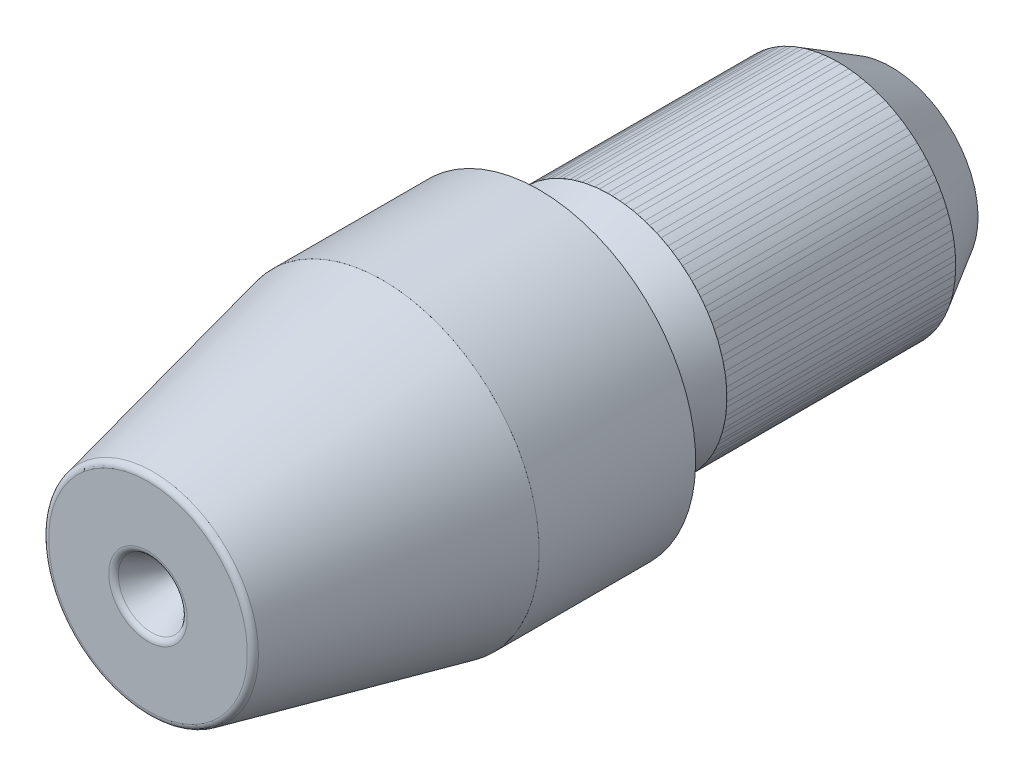
ISO-10303-21;
HEADER;
FILE_DESCRIPTION(('STEP AP214'),'2;1');
FILE_NAME('part.step','',(''),(''),'','','');
FILE_SCHEMA(('AUTOMOTIVE_DESIGN { 1 0 10303 214 1 1 1 1 }'));
ENDSEC;
DATA;
#1=APPLICATION_CONTEXT('core data for automotive mechanical design processes');
#2=APPLICATION_PROTOCOL_DEFINITION('international standard','automotive_design',2000,#1);
#3=PRODUCT_CONTEXT('',#1,'mechanical');
#4=PRODUCT('Part','Part','',(#3));
#5=PRODUCT_RELATED_PRODUCT_CATEGORY('part','',(#4));
#6=PRODUCT_DEFINITION_FORMATION('','',#4);
#7=PRODUCT_DEFINITION_CONTEXT('part definition',#1,'design');
#8=PRODUCT_DEFINITION('design','',#6,#7);
#9=PRODUCT_DEFINITION_SHAPE('','',#8);
#10=(LENGTH_UNIT() NAMED_UNIT(*) SI_UNIT(.MILLI.,.METRE.));
#11=(NAMED_UNIT(*) PLANE_ANGLE_UNIT() SI_UNIT($,.RADIAN.));
#12=(NAMED_UNIT(*) SI_UNIT($,.STERADIAN.) SOLID_ANGLE_UNIT());
#13=UNCERTAINTY_MEASURE_WITH_UNIT(LENGTH_MEASURE(1.E-05),#10,'distance_accuracy_value','');
#14=(GEOMETRIC_REPRESENTATION_CONTEXT(3) GLOBAL_UNCERTAINTY_ASSIGNED_CONTEXT((#13)) GLOBAL_UNIT_ASSIGNED_CONTEXT((#10,
#11,#12)) REPRESENTATION_CONTEXT('',''));
#15=CARTESIAN_POINT('',(0.,0.,0.));
#16=DIRECTION('',(0.,0.,1.));
#17=DIRECTION('',(1.,0.,0.));
#18=AXIS2_PLACEMENT_3D('',#15,#16,#17);
#19=CARTESIAN_POINT('',(0.,0.,-2.3));
#20=DIRECTION('',(0.,0.,-1.));
#21=DIRECTION('',(-1.,0.,0.));
#22=AXIS2_PLACEMENT_3D('',#19,#20,#21);
#23=CYLINDRICAL_SURFACE('',#22,3.001);
#24=CARTESIAN_POINT('',(0.,0.,-2.3));
#25=DIRECTION('',(0.,0.,-1.));
#26=DIRECTION('',(-1.,0.,0.));
#27=AXIS2_PLACEMENT_3D('',#24,#25,#26);
#28=CIRCLE('',#27,3.001);
#29=CARTESIAN_POINT('',(-3.001,0.,-2.3));
#30=VERTEX_POINT('',#29);
#31=EDGE_CURVE('E11',#30,#30,#28,.T.);
#32=ORIENTED_EDGE('',*,*,#31,.T.);
#33=EDGE_LOOP('',(#32));
#34=FACE_BOUND('',#33,.T.);
#35=CARTESIAN_POINT('',(0.,0.,-8.15));
#36=DIRECTION('',(0.,0.,-1.));
#37=DIRECTION('',(-1.,0.,0.));
#38=AXIS2_PLACEMENT_3D('',#35,#36,#37);
#39=CIRCLE('',#38,3.001);
#40=CARTESIAN_POINT('',(-3.001,0.,-8.15));
#41=VERTEX_POINT('',#40);
#42=EDGE_CURVE('E44',#41,#41,#39,.T.);
#43=ORIENTED_EDGE('',*,*,#42,.F.);
#44=EDGE_LOOP('',(#43));
#45=FACE_BOUND('',#44,.T.);
#46=ADVANCED_FACE('F41',(#34,#45),#23,.T.);
#47=CARTESIAN_POINT('',(0.,0.,-2.3));
#48=DIRECTION('',(0.,0.,-1.));
#49=DIRECTION('',(-1.,0.,0.));
#50=AXIS2_PLACEMENT_3D('',#47,#48,#49);
#51=PLANE('',#50);
#52=CARTESIAN_POINT('',(0.,0.,-2.3));
#53=DIRECTION('',(0.,0.,-1.));
#54=DIRECTION('',(-1.,0.,0.));
#55=AXIS2_PLACEMENT_3D('',#52,#53,#54);
#56=CIRCLE('',#55,3.);
#57=CARTESIAN_POINT('',(-3.,0.,-2.3));
#58=VERTEX_POINT('',#57);
#59=EDGE_CURVE('E51',#58,#58,#56,.T.);
#60=ORIENTED_EDGE('',*,*,#59,.T.);
#61=EDGE_LOOP('',(#60));
#62=FACE_BOUND('',#61,.T.);
#63=ORIENTED_EDGE('',*,*,#31,.F.);
#64=EDGE_LOOP('',(#63));
#65=FACE_BOUND('',#64,.T.);
#66=ADVANCED_FACE('F59',(#62,#65),#51,.F.);
#67=CARTESIAN_POINT('',(0.,0.,-8.15));
#68=DIRECTION('',(0.,0.,-1.));
#69=DIRECTION('',(-1.,0.,0.));
#70=AXIS2_PLACEMENT_3D('',#67,#68,#69);
#71=PLANE('',#70);
#72=CARTESIAN_POINT('',(0.,0.,-8.15));
#73=DIRECTION('',(0.,0.,-1.));
#74=DIRECTION('',(-1.,0.,0.));
#75=AXIS2_PLACEMENT_3D('',#72,#73,#74);
#76=CIRCLE('',#75,3.);
#77=CARTESIAN_POINT('',(-3.,0.,-8.15));
#78=VERTEX_POINT('',#77);
#79=EDGE_CURVE('E53',#78,#78,#76,.T.);
#80=ORIENTED_EDGE('',*,*,#79,.F.);
#81=EDGE_LOOP('',(#80));
#82=FACE_BOUND('',#81,.T.);
#83=ORIENTED_EDGE('',*,*,#42,.T.);
#84=EDGE_LOOP('',(#83));
#85=FACE_BOUND('',#84,.T.);
#86=ADVANCED_FACE('F65',(#82,#85),#71,.T.);
#87=CARTESIAN_POINT('',(0.,0.,-2.3));
#88=DIRECTION('',(0.,0.,-1.));
#89=DIRECTION('',(-1.,0.,0.));
#90=AXIS2_PLACEMENT_3D('',#87,#88,#89);
#91=CYLINDRICAL_SURFACE('',#90,3.);
#92=ORIENTED_EDGE('',*,*,#59,.F.);
#93=EDGE_LOOP('',(#92));
#94=FACE_BOUND('',#93,.T.);
#95=ORIENTED_EDGE('',*,*,#79,.T.);
#96=EDGE_LOOP('',(#95));
#97=FACE_BOUND('',#96,.T.);
#98=ADVANCED_FACE('F62',(#94,#97),#91,.F.);
#99=CLOSED_SHELL('',(#46,#66,#86,#98));
#100=MANIFOLD_SOLID_BREP('B2',#99);
#101=CARTESIAN_POINT('',(0.,0.,3.5));
#102=DIRECTION('',(0.,0.,-1.));
#103=DIRECTION('',(0.,1.,0.));
#104=AXIS2_PLACEMENT_3D('',#101,#102,#103);
#105=CYLINDRICAL_SURFACE('',#104,4.001);
#106=CARTESIAN_POINT('',(0.,0.,3.5));
#107=DIRECTION('',(0.,0.,-1.));
#108=DIRECTION('',(0.,1.,0.));
#109=AXIS2_PLACEMENT_3D('',#106,#107,#108);
#110=CIRCLE('',#109,4.001);
#111=CARTESIAN_POINT('',(0.,4.001,3.5));
#112=VERTEX_POINT('',#111);
#113=EDGE_CURVE('E40',#112,#112,#110,.T.);
#114=ORIENTED_EDGE('',*,*,#113,.T.);
#115=EDGE_LOOP('',(#114));
#116=FACE_BOUND('',#115,.T.);
#117=CARTESIAN_POINT('',(0.,0.,-0.500000000000001));
#118=DIRECTION('',(0.,0.,-1.));
#119=DIRECTION('',(0.,1.,0.));
#120=AXIS2_PLACEMENT_3D('',#117,#118,#119);
#121=CIRCLE('',#120,4.001);
#122=CARTESIAN_POINT('',(0.,4.001,-0.5));
#123=VERTEX_POINT('',#122);
#124=EDGE_CURVE('E112',#123,#123,#121,.T.);
#125=ORIENTED_EDGE('',*,*,#124,.F.);
#126=EDGE_LOOP('',(#125));
#127=FACE_BOUND('',#126,.T.);
#128=ADVANCED_FACE('F109',(#116,#127),#105,.T.);
#129=CARTESIAN_POINT('',(0.,0.,3.5));
#130=DIRECTION('',(0.,0.,-1.));
#131=DIRECTION('',(0.,1.,0.));
#132=AXIS2_PLACEMENT_3D('',#129,#130,#131);
#133=PLANE('',#132);
#134=CARTESIAN_POINT('',(0.,0.,3.5));
#135=DIRECTION('',(0.,0.,-1.));
#136=DIRECTION('',(0.,1.,0.));
#137=AXIS2_PLACEMENT_3D('',#134,#135,#136);
#138=CIRCLE('',#137,4.);
#139=CARTESIAN_POINT('',(0.,4.,3.5));
#140=VERTEX_POINT('',#139);
#141=EDGE_CURVE('E119',#140,#140,#138,.T.);
#142=ORIENTED_EDGE('',*,*,#141,.T.);
#143=EDGE_LOOP('',(#142));
#144=FACE_BOUND('',#143,.T.);
#145=ORIENTED_EDGE('',*,*,#113,.F.);
#146=EDGE_LOOP('',(#145));
#147=FACE_BOUND('',#146,.T.);
#148=ADVANCED_FACE('F127',(#144,#147),#133,.F.);
#149=CARTESIAN_POINT('',(0.,0.,-0.500000000000001));
#150=DIRECTION('',(0.,0.,-1.));
#151=DIRECTION('',(0.,1.,0.));
#152=AXIS2_PLACEMENT_3D('',#149,#150,#151);
#153=PLANE('',#152);
#154=CARTESIAN_POINT('',(0.,0.,-0.500000000000001));
#155=DIRECTION('',(0.,0.,-1.));
#156=DIRECTION('',(0.,1.,0.));
#157=AXIS2_PLACEMENT_3D('',#154,#155,#156);
#158=CIRCLE('',#157,4.);
#159=CARTESIAN_POINT('',(0.,4.,-0.5));
#160=VERTEX_POINT('',#159);
#161=EDGE_CURVE('E121',#160,#160,#158,.T.);
#162=ORIENTED_EDGE('',*,*,#161,.F.);
#163=EDGE_LOOP('',(#162));
#164=FACE_BOUND('',#163,.T.);
#165=ORIENTED_EDGE('',*,*,#124,.T.);
#166=EDGE_LOOP('',(#165));
#167=FACE_BOUND('',#166,.T.);
#168=ADVANCED_FACE('F133',(#164,#167),#153,.T.);
#169=CARTESIAN_POINT('',(0.,0.,3.5));
#170=DIRECTION('',(0.,0.,-1.));
#171=DIRECTION('',(0.,1.,0.));
#172=AXIS2_PLACEMENT_3D('',#169,#170,#171);
#173=CYLINDRICAL_SURFACE('',#172,4.);
#174=ORIENTED_EDGE('',*,*,#141,.F.);
#175=EDGE_LOOP('',(#174));
#176=FACE_BOUND('',#175,.T.);
#177=ORIENTED_EDGE('',*,*,#161,.T.);
#178=EDGE_LOOP('',(#177));
#179=FACE_BOUND('',#178,.T.);
#180=ADVANCED_FACE('F130',(#176,#179),#173,.F.);
#181=CLOSED_SHELL('',(#128,#148,#168,#180));
#182=MANIFOLD_SOLID_BREP('B6',#181);
#183=CARTESIAN_POINT('',(0.,0.,9.5));
#184=DIRECTION('',(0.,0.,1.));
#185=DIRECTION('',(0.,-1.,0.));
#186=AXIS2_PLACEMENT_3D('',#183,#184,#185);
#187=PLANE('',#186);
#188=CARTESIAN_POINT('',(0.,0.,9.5));
#189=DIRECTION('',(0.,0.,1.));
#190=DIRECTION('',(0.,-1.,0.));
#191=AXIS2_PLACEMENT_3D('',#188,#189,#190);
#192=CIRCLE('',#191,1.00392304845413);
#193=CARTESIAN_POINT('',(0.,-1.00392304845413,9.5));
#194=VERTEX_POINT('',#193);
#195=EDGE_CURVE('E108',#194,#194,#192,.F.);
#196=ORIENTED_EDGE('',*,*,#195,.T.);
#197=EDGE_LOOP('',(#196));
#198=FACE_BOUND('',#197,.T.);
#199=CARTESIAN_POINT('',(0.,0.,9.5));
#200=DIRECTION('',(0.,0.,1.));
#201=DIRECTION('',(0.,-1.,0.));
#202=AXIS2_PLACEMENT_3D('',#199,#200,#201);
#203=CIRCLE('',#202,2.54141844787495);
#204=CARTESIAN_POINT('',(0.,-2.54141844787495,9.5));
#205=VERTEX_POINT('',#204);
#206=EDGE_CURVE('E190',#205,#205,#203,.T.);
#207=ORIENTED_EDGE('',*,*,#206,.T.);
#208=EDGE_LOOP('',(#207));
#209=FACE_BOUND('',#208,.T.);
#210=ADVANCED_FACE('F170',(#198,#209),#187,.T.);
#211=CARTESIAN_POINT('',(0.,0.,3.5));
#212=DIRECTION('',(0.,0.,-1.));
#213=DIRECTION('',(0.,1.,0.));
#214=AXIS2_PLACEMENT_3D('',#211,#212,#213);
#215=CONICAL_SURFACE('',#214,4.,0.218166156499285);
#216=CARTESIAN_POINT('',(0.,0.,9.37463033823009));
#217=DIRECTION('',(0.,0.,1.));
#218=DIRECTION('',(0.,-1.,0.));
#219=AXIS2_PLACEMENT_3D('',#216,#217,#218);
#220=CIRCLE('',#219,2.69762580901414);
#221=CARTESIAN_POINT('',(0.,-2.69762580901414,9.37463033823009));
#222=VERTEX_POINT('',#221);
#223=EDGE_CURVE('E193',#222,#222,#220,.F.);
#224=ORIENTED_EDGE('',*,*,#223,.T.);
#225=EDGE_LOOP('',(#224));
#226=FACE_BOUND('',#225,.T.);
#227=CARTESIAN_POINT('',(0.,0.,3.5));
#228=DIRECTION('',(0.,0.,-1.));
#229=DIRECTION('',(0.,1.,0.));
#230=AXIS2_PLACEMENT_3D('',#227,#228,#229);
#231=CIRCLE('',#230,4.);
#232=CARTESIAN_POINT('',(0.,4.,3.5));
#233=VERTEX_POINT('',#232);
#234=EDGE_CURVE('E196',#233,#233,#231,.T.);
#235=ORIENTED_EDGE('',*,*,#234,.F.);
#236=EDGE_LOOP('',(#235));
#237=FACE_BOUND('',#236,.T.);
#238=ADVANCED_FACE('F250',(#226,#237),#215,.T.);
#239=CARTESIAN_POINT('',(0.,0.,-9.5));
#240=DIRECTION('',(0.,0.,-1.));
#241=DIRECTION('',(0.,1.,0.));
#242=AXIS2_PLACEMENT_3D('',#239,#240,#241);
#243=CYLINDRICAL_SURFACE('',#242,4.);
#244=ORIENTED_EDGE('',*,*,#234,.T.);
#245=EDGE_LOOP('',(#244));
#246=FACE_BOUND('',#245,.T.);
#247=CARTESIAN_POINT('',(0.,0.,-0.5));
#248=DIRECTION('',(0.,0.,-1.));
#249=DIRECTION('',(0.,1.,0.));
#250=AXIS2_PLACEMENT_3D('',#247,#248,#249);
#251=CIRCLE('',#250,4.);
#252=CARTESIAN_POINT('',(0.,4.,-0.5));
#253=VERTEX_POINT('',#252);
#254=EDGE_CURVE('E199',#253,#253,#251,.T.);
#255=ORIENTED_EDGE('',*,*,#254,.F.);
#256=EDGE_LOOP('',(#255));
#257=FACE_BOUND('',#256,.T.);
#258=ADVANCED_FACE('F255',(#246,#257),#243,.T.);
#259=CARTESIAN_POINT('',(0.,4.,-0.5));
#260=DIRECTION('',(0.,0.,-1.));
#261=DIRECTION('',(0.,1.,0.));
#262=AXIS2_PLACEMENT_3D('',#259,#260,#261);
#263=PLANE('',#262);
#264=ORIENTED_EDGE('',*,*,#254,.T.);
#265=EDGE_LOOP('',(#264));
#266=FACE_BOUND('',#265,.T.);
#267=CARTESIAN_POINT('',(0.,0.,-0.5));
#268=DIRECTION('',(0.,0.,1.));
#269=DIRECTION('',(0.,-1.,0.));
#270=AXIS2_PLACEMENT_3D('',#267,#268,#269);
#271=CIRCLE('',#270,3.);
#272=CARTESIAN_POINT('',(0.,-3.,-0.500000000000001));
#273=VERTEX_POINT('',#272);
#274=EDGE_CURVE('E222',#273,#273,#271,.T.);
#275=ORIENTED_EDGE('',*,*,#274,.T.);
#276=EDGE_LOOP('',(#275));
#277=FACE_BOUND('',#276,.T.);
#278=ADVANCED_FACE('F314',(#266,#277),#263,.T.);
#279=CARTESIAN_POINT('',(0.,0.,-0.500000000000001));
#280=DIRECTION('',(0.,0.,1.));
#281=DIRECTION('',(0.,-1.,0.));
#282=AXIS2_PLACEMENT_3D('',#279,#280,#281);
#283=TOROIDAL_SURFACE('',#282,2.75,0.124999999999999);
#284=CARTESIAN_POINT('',(0.,0.,-0.500000000000002));
#285=DIRECTION('',(0.,0.,1.));
#286=DIRECTION('',(0.,-1.,0.));
#287=AXIS2_PLACEMENT_3D('',#284,#285,#286);
#288=CIRCLE('',#287,2.625);
#289=CARTESIAN_POINT('',(0.,-2.625,-0.500000000000003));
#290=VERTEX_POINT('',#289);
#291=EDGE_CURVE('E202',#290,#290,#288,.T.);
#292=ORIENTED_EDGE('',*,*,#291,.T.);
#293=EDGE_LOOP('',(#292));
#294=FACE_BOUND('',#293,.T.);
#295=CARTESIAN_POINT('',(0.,0.,-0.391746824526947));
#296=DIRECTION('',(0.,0.,1.));
#297=DIRECTION('',(0.,-1.,0.));
#298=AXIS2_PLACEMENT_3D('',#295,#296,#297);
#299=CIRCLE('',#298,2.8125);
#300=CARTESIAN_POINT('',(0.,-2.8125,-0.391746824526947));
#301=VERTEX_POINT('',#300);
#302=EDGE_CURVE('E206',#301,#301,#299,.T.);
#303=ORIENTED_EDGE('',*,*,#302,.F.);
#304=EDGE_LOOP('',(#303));
#305=FACE_BOUND('',#304,.T.);
#306=ADVANCED_FACE('F308',(#294,#305),#283,.F.);
#307=CARTESIAN_POINT('',(0.,0.,9.5));
#308=DIRECTION('',(0.,0.,1.));
#309=DIRECTION('',(0.,-1.,0.));
#310=AXIS2_PLACEMENT_3D('',#307,#308,#309);
#311=CYLINDRICAL_SURFACE('',#310,2.625);
#312=CARTESIAN_POINT('',(0.,0.,-1.13745073217315));
#313=DIRECTION('',(0.,0.,1.));
#314=DIRECTION('',(0.,-1.,0.));
#315=AXIS2_PLACEMENT_3D('',#312,#313,#314);
#316=CIRCLE('',#315,2.625);
#317=CARTESIAN_POINT('',(0.,-2.625,-1.13745073217315));
#318=VERTEX_POINT('',#317);
#319=EDGE_CURVE('E213',#318,#318,#316,.T.);
#320=ORIENTED_EDGE('',*,*,#319,.T.);
#321=EDGE_LOOP('',(#320));
#322=FACE_BOUND('',#321,.T.);
#323=ORIENTED_EDGE('',*,*,#291,.F.);
#324=EDGE_LOOP('',(#323));
#325=FACE_BOUND('',#324,.T.);
#326=ADVANCED_FACE('F302',(#322,#325),#311,.T.);
#327=CARTESIAN_POINT('',(0.,0.,-1.13745073217315));
#328=DIRECTION('',(0.,0.,1.));
#329=DIRECTION('',(0.,-1.,0.));
#330=AXIS2_PLACEMENT_3D('',#327,#328,#329);
#331=TOROIDAL_SURFACE('',#330,3.375,0.75);
#332=CARTESIAN_POINT('',(0.,0.,-1.3939658396674));
#333=DIRECTION('',(0.,0.,1.));
#334=DIRECTION('',(0.,-1.,0.));
#335=AXIS2_PLACEMENT_3D('',#332,#333,#334);
#336=CIRCLE('',#335,2.67023053441057);
#337=CARTESIAN_POINT('',(0.,-2.67023053441056,-1.3939658396674));
#338=VERTEX_POINT('',#337);
#339=EDGE_CURVE('E216',#338,#338,#336,.T.);
#340=ORIENTED_EDGE('',*,*,#339,.T.);
#341=EDGE_LOOP('',(#340));
#342=FACE_BOUND('',#341,.T.);
#343=ORIENTED_EDGE('',*,*,#319,.F.);
#344=EDGE_LOOP('',(#343));
#345=FACE_BOUND('',#344,.T.);
#346=ADVANCED_FACE('F296',(#342,#345),#331,.F.);
#347=CARTESIAN_POINT('',(0.,0.,-1.3939658396674));
#348=DIRECTION('',(0.,0.,-1.));
#349=DIRECTION('',(0.,1.,0.));
#350=AXIS2_PLACEMENT_3D('',#347,#348,#349);
#351=CONICAL_SURFACE('',#350,2.67023053441057,0.349065850398859);
#352=CARTESIAN_POINT('',(0.,0.,-2.3));
#353=DIRECTION('',(0.,0.,1.));
#354=DIRECTION('',(0.,-1.,0.));
#355=AXIS2_PLACEMENT_3D('',#352,#353,#354);
#356=CIRCLE('',#355,3.);
#357=CARTESIAN_POINT('',(0.,-3.,-2.3));
#358=VERTEX_POINT('',#357);
#359=EDGE_CURVE('E219',#358,#358,#356,.T.);
#360=ORIENTED_EDGE('',*,*,#359,.T.);
#361=EDGE_LOOP('',(#360));
#362=FACE_BOUND('',#361,.T.);
#363=ORIENTED_EDGE('',*,*,#339,.F.);
#364=EDGE_LOOP('',(#363));
#365=FACE_BOUND('',#364,.T.);
#366=ADVANCED_FACE('F293',(#362,#365),#351,.T.);
#367=CARTESIAN_POINT('',(0.,0.,-0.5));
#368=DIRECTION('',(0.,0.,-1.));
#369=DIRECTION('',(0.,1.,0.));
#370=AXIS2_PLACEMENT_3D('',#367,#368,#369);
#371=CONICAL_SURFACE('',#370,3.,1.0471975511966);
#372=ORIENTED_EDGE('',*,*,#302,.T.);
#373=EDGE_LOOP('',(#372));
#374=FACE_BOUND('',#373,.T.);
#375=ORIENTED_EDGE('',*,*,#274,.F.);
#376=EDGE_LOOP('',(#375));
#377=FACE_BOUND('',#376,.T.);
#378=ADVANCED_FACE('F289',(#374,#377),#371,.F.);
#379=CARTESIAN_POINT('',(0.,0.,-9.5));
#380=DIRECTION('',(0.,0.,-1.));
#381=DIRECTION('',(0.,1.,0.));
#382=AXIS2_PLACEMENT_3D('',#379,#380,#381);
#383=CYLINDRICAL_SURFACE('',#382,3.);
#384=CARTESIAN_POINT('',(0.,0.,-8.15));
#385=DIRECTION('',(0.,0.,1.));
#386=DIRECTION('',(0.,-1.,0.));
#387=AXIS2_PLACEMENT_3D('',#384,#385,#386);
#388=CIRCLE('',#387,3.);
#389=CARTESIAN_POINT('',(0.,-2.99999999999999,-8.15));
#390=VERTEX_POINT('',#389);
#391=EDGE_CURVE('E207',#390,#390,#388,.T.);
#392=ORIENTED_EDGE('',*,*,#391,.T.);
#393=EDGE_LOOP('',(#392));
#394=FACE_BOUND('',#393,.T.);
#395=ORIENTED_EDGE('',*,*,#359,.F.);
#396=EDGE_LOOP('',(#395));
#397=FACE_BOUND('',#396,.T.);
#398=ADVANCED_FACE('F283',(#394,#397),#383,.T.);
#399=CARTESIAN_POINT('',(0.,0.,-8.15));
#400=DIRECTION('',(0.,0.,1.));
#401=DIRECTION('',(0.,-1.,0.));
#402=AXIS2_PLACEMENT_3D('',#399,#400,#401);
#403=CONICAL_SURFACE('',#402,3.,0.523598775598292);
#404=CARTESIAN_POINT('',(0.,0.,-9.5));
#405=DIRECTION('',(0.,0.,1.));
#406=DIRECTION('',(0.,-1.,0.));
#407=AXIS2_PLACEMENT_3D('',#404,#405,#406);
#408=CIRCLE('',#407,2.22057713659401);
#409=CARTESIAN_POINT('',(0.,-2.22057713659401,-9.5));
#410=VERTEX_POINT('',#409);
#411=EDGE_CURVE('E203',#410,#410,#408,.T.);
#412=ORIENTED_EDGE('',*,*,#411,.T.);
#413=EDGE_LOOP('',(#412));
#414=FACE_BOUND('',#413,.T.);
#415=ORIENTED_EDGE('',*,*,#391,.F.);
#416=EDGE_LOOP('',(#415));
#417=FACE_BOUND('',#416,.T.);
#418=ADVANCED_FACE('F277',(#414,#417),#403,.T.);
#419=CARTESIAN_POINT('',(0.,3.,-9.5));
#420=DIRECTION('',(0.,0.,-1.));
#421=DIRECTION('',(0.,1.,0.));
#422=AXIS2_PLACEMENT_3D('',#419,#420,#421);
#423=PLANE('',#422);
#424=CARTESIAN_POINT('',(0.,0.,-9.5));
#425=DIRECTION('',(0.,0.,-1.));
#426=DIRECTION('',(0.,1.,0.));
#427=AXIS2_PLACEMENT_3D('',#424,#425,#426);
#428=CIRCLE('',#427,1.00392304845413);
#429=CARTESIAN_POINT('',(0.,1.00392304845413,-9.5));
#430=VERTEX_POINT('',#429);
#431=EDGE_CURVE('E181',#430,#430,#428,.F.);
#432=ORIENTED_EDGE('',*,*,#431,.T.);
#433=EDGE_LOOP('',(#432));
#434=FACE_BOUND('',#433,.T.);
#435=ORIENTED_EDGE('',*,*,#411,.F.);
#436=EDGE_LOOP('',(#435));
#437=FACE_BOUND('',#436,.T.);
#438=ADVANCED_FACE('F274',(#434,#437),#423,.T.);
#439=CARTESIAN_POINT('',(0.,0.,9.5));
#440=DIRECTION('',(0.,0.,1.));
#441=DIRECTION('',(1.,0.,0.));
#442=AXIS2_PLACEMENT_3D('',#439,#440,#441);
#443=CONICAL_SURFACE('',#442,0.9,0.5235987755983);
#444=CARTESIAN_POINT('',(0.,0.,9.41));
#445=DIRECTION('',(0.,0.,1.));
#446=DIRECTION('',(1.,0.,0.));
#447=AXIS2_PLACEMENT_3D('',#444,#445,#446);
#448=CIRCLE('',#447,0.848038475772933);
#449=CARTESIAN_POINT('',(0.848038475772933,0.,9.41));
#450=VERTEX_POINT('',#449);
#451=EDGE_CURVE('E177',#450,#450,#448,.T.);
#452=ORIENTED_EDGE('',*,*,#451,.T.);
#453=EDGE_LOOP('',(#452));
#454=FACE_BOUND('',#453,.T.);
#455=CARTESIAN_POINT('',(0.,0.,8.3));
#456=DIRECTION('',(0.,0.,1.));
#457=DIRECTION('',(1.,0.,0.));
#458=AXIS2_PLACEMENT_3D('',#455,#456,#457);
#459=CIRCLE('',#458,0.207179676972447);
#460=CARTESIAN_POINT('',(0.207179676972447,0.,8.3));
#461=VERTEX_POINT('',#460);
#462=EDGE_CURVE('E210',#461,#461,#459,.T.);
#463=ORIENTED_EDGE('',*,*,#462,.F.);
#464=EDGE_LOOP('',(#463));
#465=FACE_BOUND('',#464,.T.);
#466=ADVANCED_FACE('F246',(#454,#465),#443,.F.);
#467=CARTESIAN_POINT('',(0.,0.,8.3));
#468=DIRECTION('',(0.,0.,1.));
#469=DIRECTION('',(1.,0.,0.));
#470=AXIS2_PLACEMENT_3D('',#467,#468,#469);
#471=PLANE('',#470);
#472=ORIENTED_EDGE('',*,*,#462,.T.);
#473=EDGE_LOOP('',(#472));
#474=FACE_BOUND('',#473,.T.);
#475=ADVANCED_FACE('F237',(#474),#471,.T.);
#476=CARTESIAN_POINT('',(0.,0.,-9.5));
#477=DIRECTION('',(0.,0.,-1.));
#478=DIRECTION('',(0.,1.,0.));
#479=AXIS2_PLACEMENT_3D('',#476,#477,#478);
#480=CONICAL_SURFACE('',#479,0.9,0.5235987755983);
#481=CARTESIAN_POINT('',(0.,0.,-9.41));
#482=DIRECTION('',(0.,0.,-1.));
#483=DIRECTION('',(0.,1.,0.));
#484=AXIS2_PLACEMENT_3D('',#481,#482,#483);
#485=CIRCLE('',#484,0.848038475772933);
#486=CARTESIAN_POINT('',(0.,0.848038475772935,-9.41));
#487=VERTEX_POINT('',#486);
#488=EDGE_CURVE('E185',#487,#487,#485,.T.);
#489=ORIENTED_EDGE('',*,*,#488,.T.);
#490=EDGE_LOOP('',(#489));
#491=FACE_BOUND('',#490,.T.);
#492=CARTESIAN_POINT('',(0.,0.,-8.3));
#493=DIRECTION('',(0.,0.,-1.));
#494=DIRECTION('',(0.,1.,0.));
#495=AXIS2_PLACEMENT_3D('',#492,#493,#494);
#496=CIRCLE('',#495,0.207179676972447);
#497=CARTESIAN_POINT('',(0.,0.207179676972449,-8.3));
#498=VERTEX_POINT('',#497);
#499=EDGE_CURVE('E229',#498,#498,#496,.T.);
#500=ORIENTED_EDGE('',*,*,#499,.F.);
#501=EDGE_LOOP('',(#500));
#502=FACE_BOUND('',#501,.T.);
#503=ADVANCED_FACE('F235',(#491,#502),#480,.F.);
#504=CARTESIAN_POINT('',(0.,0.,-8.3));
#505=DIRECTION('',(0.,0.,-1.));
#506=DIRECTION('',(0.,1.,0.));
#507=AXIS2_PLACEMENT_3D('',#504,#505,#506);
#508=PLANE('',#507);
#509=ORIENTED_EDGE('',*,*,#499,.T.);
#510=EDGE_LOOP('',(#509));
#511=FACE_BOUND('',#510,.T.);
#512=ADVANCED_FACE('F233',(#511),#508,.T.);
#513=CARTESIAN_POINT('',(0.,0.,9.34));
#514=DIRECTION('',(0.,0.,1.));
#515=DIRECTION('',(0.,-1.,0.));
#516=AXIS2_PLACEMENT_3D('',#513,#514,#515);
#517=TOROIDAL_SURFACE('',#516,2.54141844787495,0.16);
#518=ORIENTED_EDGE('',*,*,#206,.F.);
#519=EDGE_LOOP('',(#518));
#520=FACE_BOUND('',#519,.T.);
#521=ORIENTED_EDGE('',*,*,#223,.F.);
#522=EDGE_LOOP('',(#521));
#523=FACE_BOUND('',#522,.T.);
#524=ADVANCED_FACE('F244',(#520,#523),#517,.T.);
#525=CARTESIAN_POINT('',(0.,0.,-9.32));
#526=DIRECTION('',(0.,0.,-1.));
#527=DIRECTION('',(0.,1.,0.));
#528=AXIS2_PLACEMENT_3D('',#525,#526,#527);
#529=TOROIDAL_SURFACE('',#528,1.00392304845413,0.18);
#530=ORIENTED_EDGE('',*,*,#431,.F.);
#531=EDGE_LOOP('',(#530));
#532=FACE_BOUND('',#531,.T.);
#533=ORIENTED_EDGE('',*,*,#488,.F.);
#534=EDGE_LOOP('',(#533));
#535=FACE_BOUND('',#534,.T.);
#536=ADVANCED_FACE('F262',(#532,#535),#529,.T.);
#537=CARTESIAN_POINT('',(0.,0.,9.32));
#538=DIRECTION('',(0.,0.,1.));
#539=DIRECTION('',(0.,-1.,0.));
#540=AXIS2_PLACEMENT_3D('',#537,#538,#539);
#541=TOROIDAL_SURFACE('',#540,1.00392304845413,0.18);
#542=ORIENTED_EDGE('',*,*,#195,.F.);
#543=EDGE_LOOP('',(#542));
#544=FACE_BOUND('',#543,.T.);
#545=ORIENTED_EDGE('',*,*,#451,.F.);
#546=EDGE_LOOP('',(#545));
#547=FACE_BOUND('',#546,.T.);
#548=ADVANCED_FACE('F172',(#544,#547),#541,.T.);
#549=CLOSED_SHELL('',(#210,#238,#258,#278,#306,#326,#346,#366,#378,#398,#418,#438,#466,#475,
#503,#512,#524,#536,#548));
#550=MANIFOLD_SOLID_BREP('B35',#549);
#551=ADVANCED_BREP_SHAPE_REPRESENTATION('',(#18,#100,#182,#550),#14);
#552=SHAPE_DEFINITION_REPRESENTATION(#9,#551);
ENDSEC;
END-ISO-10303-21;
